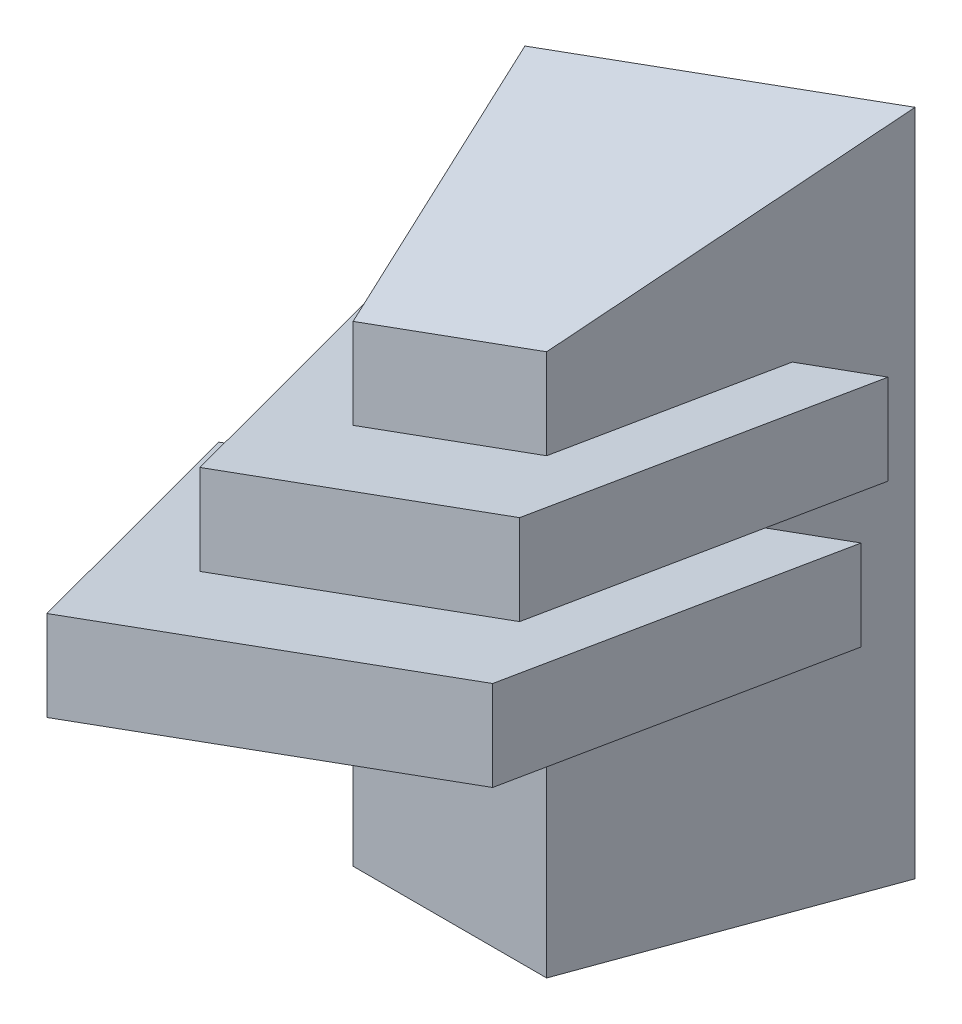
ISO-10303-21;
HEADER;
FILE_DESCRIPTION(('STEP AP214'),'2;1');
FILE_NAME('part.step','',(''),(''),'','','');
FILE_SCHEMA(('AUTOMOTIVE_DESIGN { 1 0 10303 214 1 1 1 1 }'));
ENDSEC;
DATA;
#1=APPLICATION_CONTEXT('core data for automotive mechanical design processes');
#2=APPLICATION_PROTOCOL_DEFINITION('international standard','automotive_design',2000,#1);
#3=PRODUCT_CONTEXT('',#1,'mechanical');
#4=PRODUCT('Part','Part','',(#3));
#5=PRODUCT_RELATED_PRODUCT_CATEGORY('part','',(#4));
#6=PRODUCT_DEFINITION_FORMATION('','',#4);
#7=PRODUCT_DEFINITION_CONTEXT('part definition',#1,'design');
#8=PRODUCT_DEFINITION('design','',#6,#7);
#9=PRODUCT_DEFINITION_SHAPE('','',#8);
#10=(LENGTH_UNIT() NAMED_UNIT(*) SI_UNIT(.MILLI.,.METRE.));
#11=(NAMED_UNIT(*) PLANE_ANGLE_UNIT() SI_UNIT($,.RADIAN.));
#12=(NAMED_UNIT(*) SI_UNIT($,.STERADIAN.) SOLID_ANGLE_UNIT());
#13=UNCERTAINTY_MEASURE_WITH_UNIT(LENGTH_MEASURE(1.E-05),#10,'distance_accuracy_value','');
#14=(GEOMETRIC_REPRESENTATION_CONTEXT(3) GLOBAL_UNCERTAINTY_ASSIGNED_CONTEXT((#13)) GLOBAL_UNIT_ASSIGNED_CONTEXT((#10,
#11,#12)) REPRESENTATION_CONTEXT('',''));
#15=CARTESIAN_POINT('',(0.,0.,0.));
#16=DIRECTION('',(0.,0.,1.));
#17=DIRECTION('',(1.,0.,0.));
#18=AXIS2_PLACEMENT_3D('',#15,#16,#17);
#19=CARTESIAN_POINT('',(10.5031053181943,90.,-15.));
#20=DIRECTION('',(0.939692383485188,0.,-0.342020795303337));
#21=DIRECTION('',(-0.342020795303337,0.,-0.939692383485188));
#22=AXIS2_PLACEMENT_3D('',#19,#20,#21);
#23=PLANE('',#22);
#24=DIRECTION('',(0.,-1.,0.));
#25=VECTOR('',#24,1.);
#26=CARTESIAN_POINT('',(-5.87559058180578,90.,-60.));
#27=LINE('',#26,#25);
#28=CARTESIAN_POINT('',(-5.87559058180578,53.8228048366709,-60.));
#29=VERTEX_POINT('',#28);
#30=CARTESIAN_POINT('',(-5.87559058180578,38.8228048366709,-60.));
#31=VERTEX_POINT('',#30);
#32=EDGE_CURVE('E96',#29,#31,#27,.T.);
#33=ORIENTED_EDGE('',*,*,#32,.T.);
#34=DIRECTION('',(0.339401121544519,0.123531905718771,0.932494904524315));
#35=VECTOR('',#34,1.);
#36=CARTESIAN_POINT('',(12.3988637340154,45.4741622550874,-9.79145780391765));
#37=LINE('',#36,#35);
#38=CARTESIAN_POINT('',(10.5031053181943,44.7841626203689,-15.));
#39=VERTEX_POINT('',#38);
#40=EDGE_CURVE('E56',#31,#39,#37,.T.);
#41=ORIENTED_EDGE('',*,*,#40,.T.);
#42=DIRECTION('',(0.,-1.,0.));
#43=VECTOR('',#42,1.);
#44=CARTESIAN_POINT('',(10.5031053181943,90.,-15.));
#45=LINE('',#44,#43);
#46=CARTESIAN_POINT('',(10.5031053181943,59.7841626203689,-15.));
#47=VERTEX_POINT('',#46);
#48=EDGE_CURVE('E98',#47,#39,#45,.T.);
#49=ORIENTED_EDGE('',*,*,#48,.F.);
#50=DIRECTION('',(0.339401121544519,0.123531905718771,0.932494904524315));
#51=VECTOR('',#50,1.);
#52=CARTESIAN_POINT('',(11.7699607238032,60.2452602791298,-11.5193508933516));
#53=LINE('',#52,#51);
#54=EDGE_CURVE('E100',#29,#47,#53,.T.);
#55=ORIENTED_EDGE('',*,*,#54,.F.);
#56=EDGE_LOOP('',(#33,#41,#49,#55));
#57=FACE_BOUND('',#56,.T.);
#58=ADVANCED_FACE('F42',(#57),#23,.F.);
#59=CARTESIAN_POINT('',(63.7520181335797,90.,-15.));
#60=DIRECTION('',(0.,0.,-1.));
#61=DIRECTION('',(-1.,0.,0.));
#62=AXIS2_PLACEMENT_3D('',#59,#60,#61);
#63=PLANE('',#62);
#64=ORIENTED_EDGE('',*,*,#48,.T.);
#65=DIRECTION('',(0.939692620785908,0.342020143325669,0.));
#66=VECTOR('',#65,1.);
#67=CARTESIAN_POINT('',(72.0551686226777,67.1872815208698,-15.));
#68=LINE('',#67,#66);
#69=CARTESIAN_POINT('',(63.7520181335797,64.1651818922053,-15.));
#70=VERTEX_POINT('',#69);
#71=EDGE_CURVE('E93',#39,#70,#68,.T.);
#72=ORIENTED_EDGE('',*,*,#71,.T.);
#73=DIRECTION('',(0.,-1.,0.));
#74=VECTOR('',#73,1.);
#75=CARTESIAN_POINT('',(63.7520181335797,90.,-15.));
#76=LINE('',#75,#74);
#77=CARTESIAN_POINT('',(63.7520181335797,79.1651818922053,-15.));
#78=VERTEX_POINT('',#77);
#79=EDGE_CURVE('E92',#78,#70,#76,.T.);
#80=ORIENTED_EDGE('',*,*,#79,.F.);
#81=DIRECTION('',(0.939692620785908,0.342020143325669,0.));
#82=VECTOR('',#81,1.);
#83=CARTESIAN_POINT('',(67.2342615500286,80.4326148442622,-15.));
#84=LINE('',#83,#82);
#85=EDGE_CURVE('E110',#47,#78,#84,.T.);
#86=ORIENTED_EDGE('',*,*,#85,.F.);
#87=EDGE_LOOP('',(#64,#72,#80,#86));
#88=FACE_BOUND('',#87,.T.);
#89=ADVANCED_FACE('F116',(#88),#63,.F.);
#90=CARTESIAN_POINT('',(80.1306786735797,90.,-60.));
#91=DIRECTION('',(-0.939692620799191,0.,-0.342020143289176));
#92=DIRECTION('',(-0.342020143289176,0.,0.939692620799191));
#93=AXIS2_PLACEMENT_3D('',#90,#91,#92);
#94=PLANE('',#93);
#95=ORIENTED_EDGE('',*,*,#79,.T.);
#96=DIRECTION('',(0.339400484397979,0.123531673816395,-0.932495167148086));
#97=VECTOR('',#96,1.);
#98=CARTESIAN_POINT('',(80.9639080195251,70.429797486157,-62.2892788134884));
#99=LINE('',#98,#97);
#100=CARTESIAN_POINT('',(80.1306786735797,70.1265268059158,-60.));
#101=VERTEX_POINT('',#100);
#102=EDGE_CURVE('E80',#70,#101,#99,.T.);
#103=ORIENTED_EDGE('',*,*,#102,.T.);
#104=DIRECTION('',(0.,-1.,0.));
#105=VECTOR('',#104,1.);
#106=CARTESIAN_POINT('',(80.1306786735797,90.,-60.));
#107=LINE('',#106,#105);
#108=CARTESIAN_POINT('',(80.1306786735797,85.1265268059158,-60.));
#109=VERTEX_POINT('',#108);
#110=EDGE_CURVE('E90',#109,#101,#107,.T.);
#111=ORIENTED_EDGE('',*,*,#110,.F.);
#112=DIRECTION('',(0.339400484397979,0.123531673816395,-0.932495167148086));
#113=VECTOR('',#112,1.);
#114=CARTESIAN_POINT('',(80.3350073705484,85.2008963696187,-60.5613884811358));
#115=LINE('',#114,#113);
#116=EDGE_CURVE('E63',#78,#109,#115,.T.);
#117=ORIENTED_EDGE('',*,*,#116,.F.);
#118=EDGE_LOOP('',(#95,#103,#111,#117));
#119=FACE_BOUND('',#118,.T.);
#120=ADVANCED_FACE('F89',(#119),#94,.F.);
#121=CARTESIAN_POINT('',(-5.87559058180578,90.,-60.));
#122=DIRECTION('',(0.,0.,1.));
#123=DIRECTION('',(1.,0.,0.));
#124=AXIS2_PLACEMENT_3D('',#121,#122,#123);
#125=PLANE('',#124);
#126=ORIENTED_EDGE('',*,*,#110,.T.);
#127=DIRECTION('',(-0.939692620785908,-0.342020143325669,0.));
#128=VECTOR('',#127,1.);
#129=CARTESIAN_POINT('',(10.5724428929431,44.8093994336937,-60.));
#130=LINE('',#129,#128);
#131=EDGE_CURVE('E12',#101,#31,#130,.T.);
#132=ORIENTED_EDGE('',*,*,#131,.T.);
#133=ORIENTED_EDGE('',*,*,#32,.F.);
#134=DIRECTION('',(-0.939692620785908,-0.342020143325669,0.));
#135=VECTOR('',#134,1.);
#136=CARTESIAN_POINT('',(5.75153582029409,58.054732757086,-60.));
#137=LINE('',#136,#135);
#138=EDGE_CURVE('E49',#109,#29,#137,.T.);
#139=ORIENTED_EDGE('',*,*,#138,.F.);
#140=EDGE_LOOP('',(#126,#132,#133,#139));
#141=FACE_BOUND('',#140,.T.);
#142=ADVANCED_FACE('F95',(#141),#125,.F.);
#143=CARTESIAN_POINT('',(91.472342084611,89.2545546945972,-67.1439035923523));
#144=DIRECTION('',(-0.342020143325669,0.939692620785908,0.));
#145=DIRECTION('',(-0.939692620785908,-0.342020143325669,0.));
#146=AXIS2_PLACEMENT_3D('',#143,#144,#145);
#147=PLANE('',#146);
#148=ORIENTED_EDGE('',*,*,#54,.T.);
#149=ORIENTED_EDGE('',*,*,#85,.T.);
#150=ORIENTED_EDGE('',*,*,#116,.T.);
#151=ORIENTED_EDGE('',*,*,#138,.T.);
#152=EDGE_LOOP('',(#148,#149,#150,#151));
#153=FACE_BOUND('',#152,.T.);
#154=ADVANCED_FACE('F106',(#153),#147,.T.);
#155=CARTESIAN_POINT('',(98.503946623961,76.8138494460518,-64.7913284866151));
#156=DIRECTION('',(-0.342020143325669,0.939692620785908,0.));
#157=DIRECTION('',(-0.939692620785908,-0.342020143325669,0.));
#158=AXIS2_PLACEMENT_3D('',#155,#156,#157);
#159=PLANE('',#158);
#160=ORIENTED_EDGE('',*,*,#131,.F.);
#161=ORIENTED_EDGE('',*,*,#102,.F.);
#162=ORIENTED_EDGE('',*,*,#71,.F.);
#163=ORIENTED_EDGE('',*,*,#40,.F.);
#164=EDGE_LOOP('',(#160,#161,#162,#163));
#165=FACE_BOUND('',#164,.T.);
#166=ADVANCED_FACE('F79',(#165),#159,.F.);
#167=CLOSED_SHELL('',(#58,#89,#120,#142,#154,#166));
#168=MANIFOLD_SOLID_BREP('B2',#167);
#169=CARTESIAN_POINT('',(0.,111.30370628,0.));
#170=DIRECTION('',(0.939692383485188,0.,-0.342020795303337));
#171=DIRECTION('',(-0.342020795303337,0.,-0.939692383485188));
#172=AXIS2_PLACEMENT_3D('',#169,#170,#171);
#173=PLANE('',#172);
#174=DIRECTION('',(0.339401121544519,0.123531905718771,0.932494904524315));
#175=VECTOR('',#174,1.);
#176=CARTESIAN_POINT('',(2.94923485376751,42.0347786178149,8.10293867288526));
#177=LINE('',#176,#175);
#178=CARTESIAN_POINT('',(-16.3786959000001,34.9999871334852,-45.));
#179=VERTEX_POINT('',#178);
#180=CARTESIAN_POINT('',(0.,40.9613449171831,0.));
#181=VERTEX_POINT('',#180);
#182=EDGE_CURVE('E214',#179,#181,#177,.T.);
#183=ORIENTED_EDGE('',*,*,#182,.F.);
#184=DIRECTION('',(0.,-1.,0.));
#185=VECTOR('',#184,1.);
#186=CARTESIAN_POINT('',(-16.3786959000001,111.30370628,-45.));
#187=LINE('',#186,#185);
#188=CARTESIAN_POINT('',(-16.3786959000001,19.9999871334851,-45.));
#189=VERTEX_POINT('',#188);
#190=EDGE_CURVE('E196',#179,#189,#187,.T.);
#191=ORIENTED_EDGE('',*,*,#190,.T.);
#192=DIRECTION('',(0.339401121544519,0.123531905718771,0.932494904524315));
#193=VECTOR('',#192,1.);
#194=CARTESIAN_POINT('',(3.57813786397975,27.2636805937726,9.83083176231924));
#195=LINE('',#194,#193);
#196=CARTESIAN_POINT('',(0.,25.9613449171831,0.));
#197=VERTEX_POINT('',#196);
#198=EDGE_CURVE('E227',#189,#197,#195,.T.);
#199=ORIENTED_EDGE('',*,*,#198,.T.);
#200=DIRECTION('',(0.,-1.,0.));
#201=VECTOR('',#200,1.);
#202=CARTESIAN_POINT('',(0.,111.30370628,0.));
#203=LINE('',#202,#201);
#204=EDGE_CURVE('E219',#181,#197,#203,.T.);
#205=ORIENTED_EDGE('',*,*,#204,.F.);
#206=EDGE_LOOP('',(#183,#191,#199,#205));
#207=FACE_BOUND('',#206,.T.);
#208=ADVANCED_FACE('F175',(#207),#173,.F.);
#209=CARTESIAN_POINT('',(74.2551312071595,111.30370628,0.));
#210=DIRECTION('',(0.,0.,-1.));
#211=DIRECTION('',(-1.,0.,0.));
#212=AXIS2_PLACEMENT_3D('',#209,#210,#211);
#213=PLANE('',#212);
#214=DIRECTION('',(0.939692620785908,0.342020143325669,0.));
#215=VECTOR('',#214,1.);
#216=CARTESIAN_POINT('',(88.1765300807932,73.0549772274703,0.));
#217=LINE('',#216,#215);
#218=CARTESIAN_POINT('',(74.2551312071594,67.9880024181206,0.));
#219=VERTEX_POINT('',#218);
#220=EDGE_CURVE('E221',#181,#219,#217,.T.);
#221=ORIENTED_EDGE('',*,*,#220,.F.);
#222=ORIENTED_EDGE('',*,*,#204,.T.);
#223=DIRECTION('',(0.939692620785908,0.342020143325669,0.));
#224=VECTOR('',#223,1.);
#225=CARTESIAN_POINT('',(92.9974371534423,59.809643904078,0.));
#226=LINE('',#225,#224);
#227=CARTESIAN_POINT('',(74.2551312071595,52.9880024181206,0.));
#228=VERTEX_POINT('',#227);
#229=EDGE_CURVE('E231',#197,#228,#226,.T.);
#230=ORIENTED_EDGE('',*,*,#229,.T.);
#231=DIRECTION('',(0.,-1.,0.));
#232=VECTOR('',#231,1.);
#233=CARTESIAN_POINT('',(74.2551312071595,111.30370628,0.));
#234=LINE('',#233,#232);
#235=EDGE_CURVE('E229',#219,#228,#234,.T.);
#236=ORIENTED_EDGE('',*,*,#235,.F.);
#237=EDGE_LOOP('',(#221,#222,#230,#236));
#238=FACE_BOUND('',#237,.T.);
#239=ADVANCED_FACE('F239',(#238),#213,.F.);
#240=CARTESIAN_POINT('',(90.6337917471594,111.30370628,-45.));
#241=DIRECTION('',(-0.939692620799191,0.,-0.342020143289175));
#242=DIRECTION('',(-0.342020143289175,0.,0.939692620799191));
#243=AXIS2_PLACEMENT_3D('',#240,#241,#242);
#244=PLANE('',#243);
#245=DIRECTION('',(0.339400484397979,0.123531673816395,-0.932495167148086));
#246=VECTOR('',#245,1.);
#247=CARTESIAN_POINT('',(92.1999371194668,74.5193776298846,-49.3029490465178));
#248=LINE('',#247,#246);
#249=CARTESIAN_POINT('',(90.6337917471594,73.949347331831,-45.));
#250=VERTEX_POINT('',#249);
#251=EDGE_CURVE('E188',#219,#250,#248,.T.);
#252=ORIENTED_EDGE('',*,*,#251,.F.);
#253=ORIENTED_EDGE('',*,*,#235,.T.);
#254=DIRECTION('',(0.339400484397979,0.123531673816395,-0.932495167148086));
#255=VECTOR('',#254,1.);
#256=CARTESIAN_POINT('',(92.8288377684435,59.7482787464228,-51.0308393788704));
#257=LINE('',#256,#255);
#258=CARTESIAN_POINT('',(90.6337917471594,58.9493473318309,-45.));
#259=VERTEX_POINT('',#258);
#260=EDGE_CURVE('E220',#228,#259,#257,.T.);
#261=ORIENTED_EDGE('',*,*,#260,.T.);
#262=DIRECTION('',(0.,-1.,0.));
#263=VECTOR('',#262,1.);
#264=CARTESIAN_POINT('',(90.6337917471594,111.30370628,-45.));
#265=LINE('',#264,#263);
#266=EDGE_CURVE('E226',#250,#259,#265,.T.);
#267=ORIENTED_EDGE('',*,*,#266,.F.);
#268=EDGE_LOOP('',(#252,#253,#261,#267));
#269=FACE_BOUND('',#268,.T.);
#270=ADVANCED_FACE('F249',(#269),#244,.F.);
#271=CARTESIAN_POINT('',(-16.3786959000001,111.30370628,-45.));
#272=DIRECTION('',(0.,0.,1.));
#273=DIRECTION('',(1.,0.,0.));
#274=AXIS2_PLACEMENT_3D('',#271,#272,#273);
#275=PLANE('',#274);
#276=DIRECTION('',(-0.939692620785908,-0.342020143325669,0.));
#277=VECTOR('',#276,1.);
#278=CARTESIAN_POINT('',(8.14484672019062,43.9258266859932,-45.));
#279=LINE('',#278,#277);
#280=EDGE_CURVE('E40',#250,#179,#279,.T.);
#281=ORIENTED_EDGE('',*,*,#280,.F.);
#282=ORIENTED_EDGE('',*,*,#266,.T.);
#283=DIRECTION('',(-0.939692620785908,-0.342020143325669,0.));
#284=VECTOR('',#283,1.);
#285=CARTESIAN_POINT('',(12.9657537928397,30.6804933626008,-45.));
#286=LINE('',#285,#284);
#287=EDGE_CURVE('E182',#259,#189,#286,.T.);
#288=ORIENTED_EDGE('',*,*,#287,.T.);
#289=ORIENTED_EDGE('',*,*,#190,.F.);
#290=EDGE_LOOP('',(#281,#282,#288,#289));
#291=FACE_BOUND('',#290,.T.);
#292=ADVANCED_FACE('F224',(#291),#275,.F.);
#293=CARTESIAN_POINT('',(111.383649685077,66.5016779864853,-52.9605496891565));
#294=DIRECTION('',(-0.342020143325669,0.939692620785908,0.));
#295=DIRECTION('',(-0.939692620785908,-0.342020143325669,0.));
#296=AXIS2_PLACEMENT_3D('',#293,#294,#295);
#297=PLANE('',#296);
#298=ORIENTED_EDGE('',*,*,#287,.F.);
#299=ORIENTED_EDGE('',*,*,#260,.F.);
#300=ORIENTED_EDGE('',*,*,#229,.F.);
#301=ORIENTED_EDGE('',*,*,#198,.F.);
#302=EDGE_LOOP('',(#298,#299,#300,#301));
#303=FACE_BOUND('',#302,.T.);
#304=ADVANCED_FACE('F243',(#303),#297,.F.);
#305=CARTESIAN_POINT('',(109.658836053138,80.8738971648031,-51.0778103627843));
#306=DIRECTION('',(-0.342020143325669,0.939692620785908,0.));
#307=DIRECTION('',(-0.939692620785908,-0.342020143325669,0.));
#308=AXIS2_PLACEMENT_3D('',#305,#306,#307);
#309=PLANE('',#308);
#310=ORIENTED_EDGE('',*,*,#182,.T.);
#311=ORIENTED_EDGE('',*,*,#220,.T.);
#312=ORIENTED_EDGE('',*,*,#251,.T.);
#313=ORIENTED_EDGE('',*,*,#280,.T.);
#314=EDGE_LOOP('',(#310,#311,#312,#313));
#315=FACE_BOUND('',#314,.T.);
#316=ADVANCED_FACE('F213',(#315),#309,.T.);
#317=CLOSED_SHELL('',(#208,#239,#270,#292,#304,#316));
#318=MANIFOLD_SOLID_BREP('B6',#317);
#319=CARTESIAN_POINT('',(4.6275656,111.30370628,-75.));
#320=DIRECTION('',(0.939692383485188,0.,-0.342020795303335));
#321=DIRECTION('',(-0.342020795303335,0.,-0.939692383485188));
#322=AXIS2_PLACEMENT_3D('',#319,#320,#321);
#323=PLANE('',#322);
#324=DIRECTION('',(0.336086668474071,-0.185470636279785,0.923388539214112));
#325=VECTOR('',#324,1.);
#326=CARTESIAN_POINT('',(3.15285883539928,88.4594632825359,-79.0517147892728));
#327=LINE('',#326,#325);
#328=CARTESIAN_POINT('',(4.6275656,87.6456410526973,-74.9999999999998));
#329=VERTEX_POINT('',#328);
#330=CARTESIAN_POINT('',(21.0062615,78.6069988363951,-30.));
#331=VERTEX_POINT('',#330);
#332=EDGE_CURVE('E359',#329,#331,#327,.T.);
#333=ORIENTED_EDGE('',*,*,#332,.F.);
#334=DIRECTION('',(0.,-1.,0.));
#335=VECTOR('',#334,1.);
#336=CARTESIAN_POINT('',(4.6275656,111.30370628,-75.));
#337=LINE('',#336,#335);
#338=CARTESIAN_POINT('',(4.6275656,0.,-75.));
#339=VERTEX_POINT('',#338);
#340=EDGE_CURVE('E348',#329,#339,#337,.T.);
#341=ORIENTED_EDGE('',*,*,#340,.T.);
#342=DIRECTION('',(0.342020795303335,0.,0.939692383485188));
#343=VECTOR('',#342,1.);
#344=CARTESIAN_POINT('',(4.6275656,0.,-75.));
#345=LINE('',#344,#343);
#346=CARTESIAN_POINT('',(21.0062615,0.,-30.));
#347=VERTEX_POINT('',#346);
#348=EDGE_CURVE('E352',#339,#347,#345,.T.);
#349=ORIENTED_EDGE('',*,*,#348,.T.);
#350=DIRECTION('',(0.,-1.,0.));
#351=VECTOR('',#350,1.);
#352=CARTESIAN_POINT('',(21.0062615,111.30370628,-30.));
#353=LINE('',#352,#351);
#354=EDGE_CURVE('E173',#331,#347,#353,.T.);
#355=ORIENTED_EDGE('',*,*,#354,.F.);
#356=EDGE_LOOP('',(#333,#341,#349,#355));
#357=FACE_BOUND('',#356,.T.);
#358=ADVANCED_FACE('F299',(#357),#323,.F.);
#359=CARTESIAN_POINT('',(21.0062615,111.30370628,-30.));
#360=DIRECTION('',(0.,0.,-1.));
#361=DIRECTION('',(-1.,0.,0.));
#362=AXIS2_PLACEMENT_3D('',#359,#360,#361);
#363=PLANE('',#362);
#364=DIRECTION('',(0.93969262078591,0.342020143325663,0.));
#365=VECTOR('',#364,1.);
#366=CARTESIAN_POINT('',(31.5147807111473,82.4317870354672,-30.));
#367=LINE('',#366,#365);
#368=CARTESIAN_POINT('',(53.24890506,90.3423613662898,-30.));
#369=VERTEX_POINT('',#368);
#370=EDGE_CURVE('E362',#331,#369,#367,.T.);
#371=ORIENTED_EDGE('',*,*,#370,.F.);
#372=ORIENTED_EDGE('',*,*,#354,.T.);
#373=DIRECTION('',(1.,0.,0.));
#374=VECTOR('',#373,1.);
#375=CARTESIAN_POINT('',(21.0062615,0.,-30.));
#376=LINE('',#375,#374);
#377=CARTESIAN_POINT('',(53.24890506,0.,-30.));
#378=VERTEX_POINT('',#377);
#379=EDGE_CURVE('E340',#347,#378,#376,.T.);
#380=ORIENTED_EDGE('',*,*,#379,.T.);
#381=DIRECTION('',(0.,-1.,0.));
#382=VECTOR('',#381,1.);
#383=CARTESIAN_POINT('',(53.24890506,111.30370628,-30.));
#384=LINE('',#383,#382);
#385=EDGE_CURVE('E307',#369,#378,#384,.T.);
#386=ORIENTED_EDGE('',*,*,#385,.F.);
#387=EDGE_LOOP('',(#371,#372,#380,#386));
#388=FACE_BOUND('',#387,.T.);
#389=ADVANCED_FACE('F371',(#388),#363,.F.);
#390=CARTESIAN_POINT('',(53.24890506,111.30370628,-30.));
#391=DIRECTION('',(-0.939692620799191,0.,-0.342020143289175));
#392=DIRECTION('',(-0.342020143289175,0.,0.939692620799191));
#393=AXIS2_PLACEMENT_3D('',#390,#391,#392);
#394=PLANE('',#393);
#395=DIRECTION('',(0.313319403021753,0.400984931512402,-0.860837984983288));
#396=VECTOR('',#395,1.);
#397=CARTESIAN_POINT('',(55.8824121222936,93.7127132781945,-37.2355011885002));
#398=LINE('',#397,#396);
#399=CARTESIAN_POINT('',(69.6275656,111.30370628,-75.));
#400=VERTEX_POINT('',#399);
#401=EDGE_CURVE('E314',#369,#400,#398,.T.);
#402=ORIENTED_EDGE('',*,*,#401,.F.);
#403=ORIENTED_EDGE('',*,*,#385,.T.);
#404=DIRECTION('',(0.342020143289175,0.,-0.939692620799191));
#405=VECTOR('',#404,1.);
#406=CARTESIAN_POINT('',(53.24890506,0.,-30.));
#407=LINE('',#406,#405);
#408=CARTESIAN_POINT('',(69.6275656,0.,-75.));
#409=VERTEX_POINT('',#408);
#410=EDGE_CURVE('E330',#378,#409,#407,.T.);
#411=ORIENTED_EDGE('',*,*,#410,.T.);
#412=DIRECTION('',(0.,-1.,0.));
#413=VECTOR('',#412,1.);
#414=CARTESIAN_POINT('',(69.6275656,111.30370628,-75.));
#415=LINE('',#414,#413);
#416=EDGE_CURVE('E333',#400,#409,#415,.T.);
#417=ORIENTED_EDGE('',*,*,#416,.F.);
#418=EDGE_LOOP('',(#402,#403,#411,#417));
#419=FACE_BOUND('',#418,.T.);
#420=ADVANCED_FACE('F332',(#419),#394,.F.);
#421=CARTESIAN_POINT('',(69.6275656,111.30370628,-75.));
#422=DIRECTION('',(0.,0.,1.));
#423=DIRECTION('',(1.,0.,0.));
#424=AXIS2_PLACEMENT_3D('',#421,#422,#423);
#425=PLANE('',#424);
#426=ORIENTED_EDGE('',*,*,#340,.F.);
#427=DIRECTION('',(0.93969262078591,0.342020143325663,0.));
#428=VECTOR('',#427,1.);
#429=CARTESIAN_POINT('',(4.6275656,87.6456410526973,-75.));
#430=LINE('',#429,#428);
#431=EDGE_CURVE('E347',#329,#400,#430,.T.);
#432=ORIENTED_EDGE('',*,*,#431,.T.);
#433=ORIENTED_EDGE('',*,*,#416,.T.);
#434=DIRECTION('',(-1.,0.,0.));
#435=VECTOR('',#434,1.);
#436=CARTESIAN_POINT('',(69.6275656,0.,-75.));
#437=LINE('',#436,#435);
#438=EDGE_CURVE('E339',#409,#339,#437,.T.);
#439=ORIENTED_EDGE('',*,*,#438,.T.);
#440=EDGE_LOOP('',(#426,#432,#433,#439));
#441=FACE_BOUND('',#440,.T.);
#442=ADVANCED_FACE('F345',(#441),#425,.F.);
#443=CARTESIAN_POINT('',(4.62756559999999,0.,-75.));
#444=DIRECTION('',(0.,-1.,0.));
#445=DIRECTION('',(0.,0.,-1.));
#446=AXIS2_PLACEMENT_3D('',#443,#444,#445);
#447=PLANE('',#446);
#448=ORIENTED_EDGE('',*,*,#348,.F.);
#449=ORIENTED_EDGE('',*,*,#438,.F.);
#450=ORIENTED_EDGE('',*,*,#410,.F.);
#451=ORIENTED_EDGE('',*,*,#379,.F.);
#452=EDGE_LOOP('',(#448,#449,#450,#451));
#453=FACE_BOUND('',#452,.T.);
#454=ADVANCED_FACE('F350',(#453),#447,.T.);
#455=CARTESIAN_POINT('',(79.1785735403475,115.510690979413,-77.1921063056603));
#456=DIRECTION('',(-0.326383393383738,0.89673100340681,0.298910334468937));
#457=DIRECTION('',(-0.93969262078591,-0.342020143325663,0.));
#458=AXIS2_PLACEMENT_3D('',#455,#456,#457);
#459=PLANE('',#458);
#460=ORIENTED_EDGE('',*,*,#332,.T.);
#461=ORIENTED_EDGE('',*,*,#370,.T.);
#462=ORIENTED_EDGE('',*,*,#401,.T.);
#463=ORIENTED_EDGE('',*,*,#431,.F.);
#464=EDGE_LOOP('',(#460,#461,#462,#463));
#465=FACE_BOUND('',#464,.T.);
#466=ADVANCED_FACE('F366',(#465),#459,.T.);
#467=CLOSED_SHELL('',(#358,#389,#420,#442,#454,#466));
#468=MANIFOLD_SOLID_BREP('B34',#467);
#469=ADVANCED_BREP_SHAPE_REPRESENTATION('',(#18,#168,#318,#468),#14);
#470=SHAPE_DEFINITION_REPRESENTATION(#9,#469);
ENDSEC;
END-ISO-10303-21;
